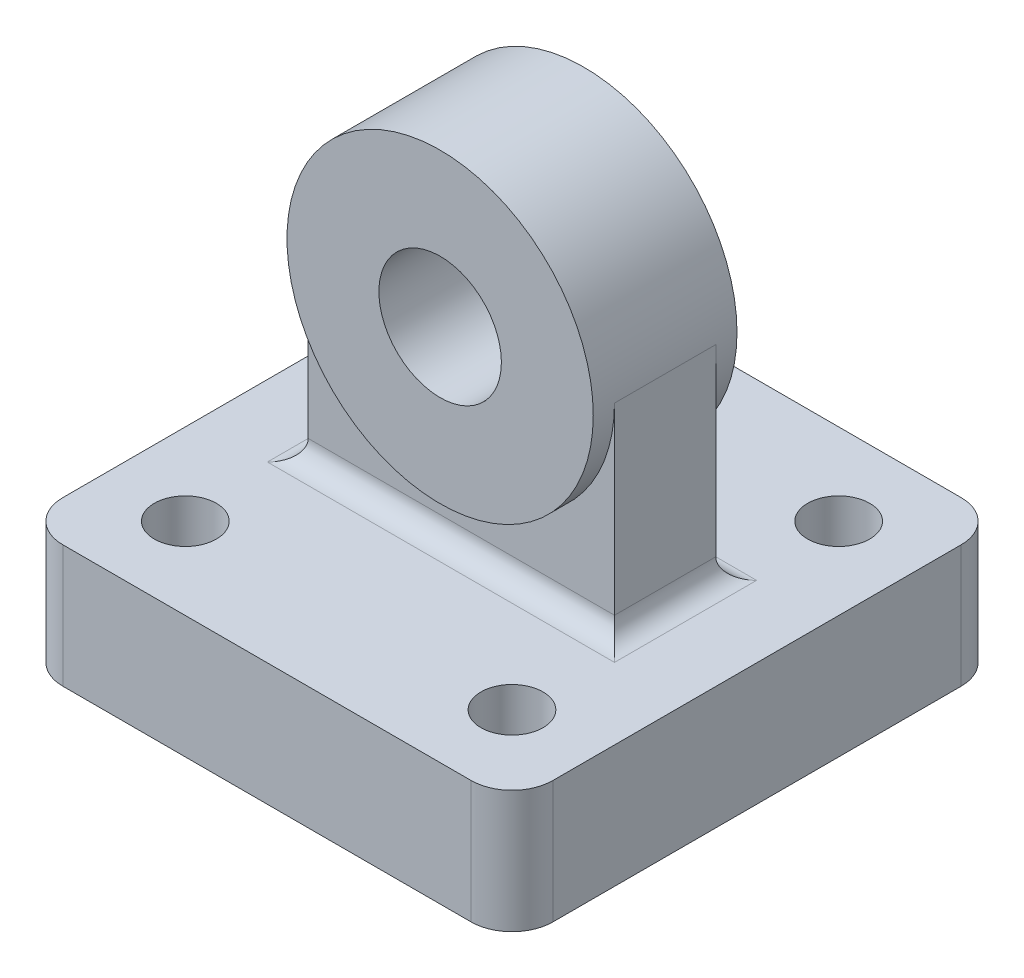
ISO-10303-21;
HEADER;
FILE_DESCRIPTION(('STEP AP214'),'2;1');
FILE_NAME('part.step','',(''),(''),'','','');
FILE_SCHEMA(('AUTOMOTIVE_DESIGN { 1 0 10303 214 1 1 1 1 }'));
ENDSEC;
DATA;
#1=APPLICATION_CONTEXT('core data for automotive mechanical design processes');
#2=APPLICATION_PROTOCOL_DEFINITION('international standard','automotive_design',2000,#1);
#3=PRODUCT_CONTEXT('',#1,'mechanical');
#4=PRODUCT('Part','Part','',(#3));
#5=PRODUCT_RELATED_PRODUCT_CATEGORY('part','',(#4));
#6=PRODUCT_DEFINITION_FORMATION('','',#4);
#7=PRODUCT_DEFINITION_CONTEXT('part definition',#1,'design');
#8=PRODUCT_DEFINITION('design','',#6,#7);
#9=PRODUCT_DEFINITION_SHAPE('','',#8);
#10=(LENGTH_UNIT() NAMED_UNIT(*) SI_UNIT(.MILLI.,.METRE.));
#11=(NAMED_UNIT(*) PLANE_ANGLE_UNIT() SI_UNIT($,.RADIAN.));
#12=(NAMED_UNIT(*) SI_UNIT($,.STERADIAN.) SOLID_ANGLE_UNIT());
#13=UNCERTAINTY_MEASURE_WITH_UNIT(LENGTH_MEASURE(1.E-05),#10,'distance_accuracy_value','');
#14=(GEOMETRIC_REPRESENTATION_CONTEXT(3) GLOBAL_UNCERTAINTY_ASSIGNED_CONTEXT((#13)) GLOBAL_UNIT_ASSIGNED_CONTEXT((#10,
#11,#12)) REPRESENTATION_CONTEXT('',''));
#15=CARTESIAN_POINT('',(0.,0.,0.));
#16=DIRECTION('',(0.,0.,1.));
#17=DIRECTION('',(1.,0.,0.));
#18=AXIS2_PLACEMENT_3D('',#15,#16,#17);
#19=CARTESIAN_POINT('',(0.,19.05,0.));
#20=DIRECTION('',(0.,1.,0.));
#21=DIRECTION('',(0.,0.,1.));
#22=AXIS2_PLACEMENT_3D('',#19,#20,#21);
#23=PLANE('',#22);
#24=DIRECTION('',(0.,0.,-1.));
#25=VECTOR('',#24,1.);
#26=CARTESIAN_POINT('',(11.1125,19.05,0.));
#27=LINE('',#26,#25);
#28=CARTESIAN_POINT('',(11.1125,19.05,49.149));
#29=VERTEX_POINT('',#28);
#30=CARTESIAN_POINT('',(11.1125,19.05,27.051));
#31=VERTEX_POINT('',#30);
#32=EDGE_CURVE('E247',#29,#31,#27,.T.);
#33=ORIENTED_EDGE('',*,*,#32,.T.);
#34=DIRECTION('',(1.,0.,0.));
#35=VECTOR('',#34,1.);
#36=CARTESIAN_POINT('',(0.,19.05,27.051));
#37=LINE('',#36,#35);
#38=CARTESIAN_POINT('',(65.0875,19.05,27.051));
#39=VERTEX_POINT('',#38);
#40=EDGE_CURVE('E250',#31,#39,#37,.T.);
#41=ORIENTED_EDGE('',*,*,#40,.T.);
#42=DIRECTION('',(0.,0.,-1.));
#43=VECTOR('',#42,1.);
#44=CARTESIAN_POINT('',(65.0875,19.05,45.974));
#45=LINE('',#44,#43);
#46=CARTESIAN_POINT('',(65.0875,19.05,49.149));
#47=VERTEX_POINT('',#46);
#48=EDGE_CURVE('E228',#39,#47,#45,.F.);
#49=ORIENTED_EDGE('',*,*,#48,.T.);
#50=DIRECTION('',(1.,0.,0.));
#51=VECTOR('',#50,1.);
#52=CARTESIAN_POINT('',(14.2875,19.05,49.149));
#53=LINE('',#52,#51);
#54=EDGE_CURVE('E244',#47,#29,#53,.F.);
#55=ORIENTED_EDGE('',*,*,#54,.T.);
#56=EDGE_LOOP('',(#33,#41,#49,#55));
#57=FACE_BOUND('',#56,.T.);
#58=CARTESIAN_POINT('',(63.4999999999999,19.05,12.7));
#59=DIRECTION('',(0.,1.,0.));
#60=DIRECTION('',(0.,0.,-1.));
#61=AXIS2_PLACEMENT_3D('',#58,#59,#60);
#62=CIRCLE('',#61,4.826);
#63=CARTESIAN_POINT('',(63.4999999999999,19.05,7.874));
#64=VERTEX_POINT('',#63);
#65=EDGE_CURVE('E189',#64,#64,#62,.T.);
#66=ORIENTED_EDGE('',*,*,#65,.F.);
#67=EDGE_LOOP('',(#66));
#68=FACE_BOUND('',#67,.T.);
#69=CARTESIAN_POINT('',(63.5,19.05,63.5));
#70=DIRECTION('',(0.,1.,0.));
#71=DIRECTION('',(0.,0.,1.));
#72=AXIS2_PLACEMENT_3D('',#69,#70,#71);
#73=CIRCLE('',#72,4.826);
#74=CARTESIAN_POINT('',(63.5,19.05,68.326));
#75=VERTEX_POINT('',#74);
#76=EDGE_CURVE('E205',#75,#75,#73,.T.);
#77=ORIENTED_EDGE('',*,*,#76,.F.);
#78=EDGE_LOOP('',(#77));
#79=FACE_BOUND('',#78,.T.);
#80=DIRECTION('',(1.,0.,0.));
#81=VECTOR('',#80,1.);
#82=CARTESIAN_POINT('',(0.,19.05,76.2));
#83=LINE('',#82,#81);
#84=CARTESIAN_POINT('',(6.35,19.05,76.2));
#85=VERTEX_POINT('',#84);
#86=CARTESIAN_POINT('',(69.85,19.05,76.2));
#87=VERTEX_POINT('',#86);
#88=EDGE_CURVE('E217',#85,#87,#83,.T.);
#89=ORIENTED_EDGE('',*,*,#88,.T.);
#90=CARTESIAN_POINT('',(69.85,19.05,69.85));
#91=DIRECTION('',(0.,1.,0.));
#92=DIRECTION('',(0.,0.,1.));
#93=AXIS2_PLACEMENT_3D('',#90,#91,#92);
#94=CIRCLE('',#93,6.35);
#95=CARTESIAN_POINT('',(76.2,19.05,69.85));
#96=VERTEX_POINT('',#95);
#97=EDGE_CURVE('E314',#87,#96,#94,.T.);
#98=ORIENTED_EDGE('',*,*,#97,.T.);
#99=DIRECTION('',(0.,0.,-1.));
#100=VECTOR('',#99,1.);
#101=CARTESIAN_POINT('',(76.2,19.05,0.));
#102=LINE('',#101,#100);
#103=CARTESIAN_POINT('',(76.2,19.05,6.35));
#104=VERTEX_POINT('',#103);
#105=EDGE_CURVE('E222',#96,#104,#102,.T.);
#106=ORIENTED_EDGE('',*,*,#105,.T.);
#107=CARTESIAN_POINT('',(69.85,19.05,6.35));
#108=DIRECTION('',(0.,1.,0.));
#109=DIRECTION('',(0.,0.,1.));
#110=AXIS2_PLACEMENT_3D('',#107,#108,#109);
#111=CIRCLE('',#110,6.35);
#112=CARTESIAN_POINT('',(69.85,19.05,0.));
#113=VERTEX_POINT('',#112);
#114=EDGE_CURVE('E61',#104,#113,#111,.T.);
#115=ORIENTED_EDGE('',*,*,#114,.T.);
#116=DIRECTION('',(-1.,0.,0.));
#117=VECTOR('',#116,1.);
#118=CARTESIAN_POINT('',(0.,19.05,0.));
#119=LINE('',#118,#117);
#120=CARTESIAN_POINT('',(6.35,19.05,0.));
#121=VERTEX_POINT('',#120);
#122=EDGE_CURVE('E225',#113,#121,#119,.T.);
#123=ORIENTED_EDGE('',*,*,#122,.T.);
#124=CARTESIAN_POINT('',(6.35,19.05,6.35));
#125=DIRECTION('',(0.,1.,0.));
#126=DIRECTION('',(0.,0.,1.));
#127=AXIS2_PLACEMENT_3D('',#124,#125,#126);
#128=CIRCLE('',#127,6.35);
#129=CARTESIAN_POINT('',(0.,19.05,6.35));
#130=VERTEX_POINT('',#129);
#131=EDGE_CURVE('E306',#121,#130,#128,.T.);
#132=ORIENTED_EDGE('',*,*,#131,.T.);
#133=DIRECTION('',(0.,0.,1.));
#134=VECTOR('',#133,1.);
#135=CARTESIAN_POINT('',(0.,19.05,0.));
#136=LINE('',#135,#134);
#137=CARTESIAN_POINT('',(0.,19.05,69.85));
#138=VERTEX_POINT('',#137);
#139=EDGE_CURVE('E213',#130,#138,#136,.T.);
#140=ORIENTED_EDGE('',*,*,#139,.T.);
#141=CARTESIAN_POINT('',(6.35,19.05,69.85));
#142=DIRECTION('',(0.,1.,0.));
#143=DIRECTION('',(0.,0.,1.));
#144=AXIS2_PLACEMENT_3D('',#141,#142,#143);
#145=CIRCLE('',#144,6.35);
#146=EDGE_CURVE('E311',#138,#85,#145,.T.);
#147=ORIENTED_EDGE('',*,*,#146,.T.);
#148=EDGE_LOOP('',(#89,#98,#106,#115,#123,#132,#140,#147));
#149=FACE_BOUND('',#148,.T.);
#150=CARTESIAN_POINT('',(12.7,19.05,63.5));
#151=DIRECTION('',(0.,1.,0.));
#152=DIRECTION('',(0.,0.,-1.));
#153=AXIS2_PLACEMENT_3D('',#150,#151,#152);
#154=CIRCLE('',#153,4.826);
#155=CARTESIAN_POINT('',(12.7,19.05,58.674));
#156=VERTEX_POINT('',#155);
#157=EDGE_CURVE('E197',#156,#156,#154,.T.);
#158=ORIENTED_EDGE('',*,*,#157,.F.);
#159=EDGE_LOOP('',(#158));
#160=FACE_BOUND('',#159,.T.);
#161=CARTESIAN_POINT('',(12.7,19.05,12.7));
#162=DIRECTION('',(0.,1.,0.));
#163=DIRECTION('',(0.,0.,1.));
#164=AXIS2_PLACEMENT_3D('',#161,#162,#163);
#165=CIRCLE('',#164,4.826);
#166=CARTESIAN_POINT('',(12.7,19.05,17.526));
#167=VERTEX_POINT('',#166);
#168=EDGE_CURVE('E181',#167,#167,#165,.T.);
#169=ORIENTED_EDGE('',*,*,#168,.F.);
#170=EDGE_LOOP('',(#169));
#171=FACE_BOUND('',#170,.T.);
#172=ADVANCED_FACE('F39',(#57,#68,#79,#149,#160,#171),#23,.T.);
#173=CARTESIAN_POINT('',(0.,0.,0.));
#174=DIRECTION('',(0.,1.,0.));
#175=DIRECTION('',(0.,0.,1.));
#176=AXIS2_PLACEMENT_3D('',#173,#174,#175);
#177=PLANE('',#176);
#178=DIRECTION('',(0.,0.,-1.));
#179=VECTOR('',#178,1.);
#180=CARTESIAN_POINT('',(76.2,0.,0.));
#181=LINE('',#180,#179);
#182=CARTESIAN_POINT('',(76.2,0.,69.85));
#183=VERTEX_POINT('',#182);
#184=CARTESIAN_POINT('',(76.2,0.,6.35));
#185=VERTEX_POINT('',#184);
#186=EDGE_CURVE('E236',#183,#185,#181,.T.);
#187=ORIENTED_EDGE('',*,*,#186,.F.);
#188=CARTESIAN_POINT('',(69.85,0.,69.85));
#189=DIRECTION('',(0.,1.,0.));
#190=DIRECTION('',(0.,0.,1.));
#191=AXIS2_PLACEMENT_3D('',#188,#189,#190);
#192=CIRCLE('',#191,6.35);
#193=CARTESIAN_POINT('',(69.85,0.,76.2));
#194=VERTEX_POINT('',#193);
#195=EDGE_CURVE('E296',#183,#194,#192,.F.);
#196=ORIENTED_EDGE('',*,*,#195,.T.);
#197=DIRECTION('',(1.,0.,0.));
#198=VECTOR('',#197,1.);
#199=CARTESIAN_POINT('',(0.,0.,76.2));
#200=LINE('',#199,#198);
#201=CARTESIAN_POINT('',(6.35,0.,76.2));
#202=VERTEX_POINT('',#201);
#203=EDGE_CURVE('E232',#202,#194,#200,.T.);
#204=ORIENTED_EDGE('',*,*,#203,.F.);
#205=CARTESIAN_POINT('',(6.35,0.,69.85));
#206=DIRECTION('',(0.,1.,0.));
#207=DIRECTION('',(0.,0.,1.));
#208=AXIS2_PLACEMENT_3D('',#205,#206,#207);
#209=CIRCLE('',#208,6.35);
#210=CARTESIAN_POINT('',(0.,0.,69.85));
#211=VERTEX_POINT('',#210);
#212=EDGE_CURVE('E293',#202,#211,#209,.F.);
#213=ORIENTED_EDGE('',*,*,#212,.T.);
#214=DIRECTION('',(0.,0.,1.));
#215=VECTOR('',#214,1.);
#216=CARTESIAN_POINT('',(0.,0.,0.));
#217=LINE('',#216,#215);
#218=CARTESIAN_POINT('',(0.,0.,6.35));
#219=VERTEX_POINT('',#218);
#220=EDGE_CURVE('E209',#219,#211,#217,.T.);
#221=ORIENTED_EDGE('',*,*,#220,.F.);
#222=CARTESIAN_POINT('',(6.35,0.,6.35));
#223=DIRECTION('',(0.,1.,0.));
#224=DIRECTION('',(0.,0.,1.));
#225=AXIS2_PLACEMENT_3D('',#222,#223,#224);
#226=CIRCLE('',#225,6.35);
#227=CARTESIAN_POINT('',(6.35,0.,0.));
#228=VERTEX_POINT('',#227);
#229=EDGE_CURVE('E287',#219,#228,#226,.F.);
#230=ORIENTED_EDGE('',*,*,#229,.T.);
#231=DIRECTION('',(-1.,0.,0.));
#232=VECTOR('',#231,1.);
#233=CARTESIAN_POINT('',(0.,0.,0.));
#234=LINE('',#233,#232);
#235=CARTESIAN_POINT('',(69.85,0.,0.));
#236=VERTEX_POINT('',#235);
#237=EDGE_CURVE('E218',#236,#228,#234,.T.);
#238=ORIENTED_EDGE('',*,*,#237,.F.);
#239=CARTESIAN_POINT('',(69.85,0.,6.35));
#240=DIRECTION('',(0.,1.,0.));
#241=DIRECTION('',(0.,0.,1.));
#242=AXIS2_PLACEMENT_3D('',#239,#240,#241);
#243=CIRCLE('',#242,6.35);
#244=EDGE_CURVE('E290',#236,#185,#243,.F.);
#245=ORIENTED_EDGE('',*,*,#244,.T.);
#246=EDGE_LOOP('',(#187,#196,#204,#213,#221,#230,#238,#245));
#247=FACE_BOUND('',#246,.T.);
#248=CARTESIAN_POINT('',(63.5,0.,63.5));
#249=DIRECTION('',(0.,1.,0.));
#250=DIRECTION('',(0.,0.,1.));
#251=AXIS2_PLACEMENT_3D('',#248,#249,#250);
#252=CIRCLE('',#251,4.826);
#253=CARTESIAN_POINT('',(63.5,0.,68.326));
#254=VERTEX_POINT('',#253);
#255=EDGE_CURVE('E201',#254,#254,#252,.T.);
#256=ORIENTED_EDGE('',*,*,#255,.T.);
#257=EDGE_LOOP('',(#256));
#258=FACE_BOUND('',#257,.T.);
#259=CARTESIAN_POINT('',(12.7,0.,63.5));
#260=DIRECTION('',(0.,1.,0.));
#261=DIRECTION('',(0.,0.,-1.));
#262=AXIS2_PLACEMENT_3D('',#259,#260,#261);
#263=CIRCLE('',#262,4.826);
#264=CARTESIAN_POINT('',(12.7,0.,58.674));
#265=VERTEX_POINT('',#264);
#266=EDGE_CURVE('E193',#265,#265,#263,.T.);
#267=ORIENTED_EDGE('',*,*,#266,.T.);
#268=EDGE_LOOP('',(#267));
#269=FACE_BOUND('',#268,.T.);
#270=CARTESIAN_POINT('',(63.4999999999999,0.,12.7));
#271=DIRECTION('',(0.,1.,0.));
#272=DIRECTION('',(0.,0.,-1.));
#273=AXIS2_PLACEMENT_3D('',#270,#271,#272);
#274=CIRCLE('',#273,4.826);
#275=CARTESIAN_POINT('',(63.4999999999999,0.,7.874));
#276=VERTEX_POINT('',#275);
#277=EDGE_CURVE('E185',#276,#276,#274,.T.);
#278=ORIENTED_EDGE('',*,*,#277,.T.);
#279=EDGE_LOOP('',(#278));
#280=FACE_BOUND('',#279,.T.);
#281=CARTESIAN_POINT('',(12.7,0.,12.7));
#282=DIRECTION('',(0.,1.,0.));
#283=DIRECTION('',(0.,0.,1.));
#284=AXIS2_PLACEMENT_3D('',#281,#282,#283);
#285=CIRCLE('',#284,4.826);
#286=CARTESIAN_POINT('',(12.7,0.,17.526));
#287=VERTEX_POINT('',#286);
#288=EDGE_CURVE('E164',#287,#287,#285,.T.);
#289=ORIENTED_EDGE('',*,*,#288,.T.);
#290=EDGE_LOOP('',(#289));
#291=FACE_BOUND('',#290,.T.);
#292=ADVANCED_FACE('F371',(#247,#258,#269,#280,#291),#177,.F.);
#293=CARTESIAN_POINT('',(0.,19.05,0.));
#294=DIRECTION('',(1.,0.,0.));
#295=DIRECTION('',(0.,0.,-1.));
#296=AXIS2_PLACEMENT_3D('',#293,#294,#295);
#297=PLANE('',#296);
#298=ORIENTED_EDGE('',*,*,#220,.T.);
#299=DIRECTION('',(0.,-1.,0.));
#300=VECTOR('',#299,1.);
#301=CARTESIAN_POINT('',(0.,19.05,69.85));
#302=LINE('',#301,#300);
#303=EDGE_CURVE('E321',#211,#138,#302,.F.);
#304=ORIENTED_EDGE('',*,*,#303,.T.);
#305=ORIENTED_EDGE('',*,*,#139,.F.);
#306=DIRECTION('',(0.,-1.,0.));
#307=VECTOR('',#306,1.);
#308=CARTESIAN_POINT('',(0.,19.05,6.35));
#309=LINE('',#308,#307);
#310=EDGE_CURVE('E317',#130,#219,#309,.T.);
#311=ORIENTED_EDGE('',*,*,#310,.T.);
#312=EDGE_LOOP('',(#298,#304,#305,#311));
#313=FACE_BOUND('',#312,.T.);
#314=ADVANCED_FACE('F377',(#313),#297,.F.);
#315=CARTESIAN_POINT('',(0.,19.05,76.2));
#316=DIRECTION('',(0.,0.,-1.));
#317=DIRECTION('',(-1.,0.,0.));
#318=AXIS2_PLACEMENT_3D('',#315,#316,#317);
#319=PLANE('',#318);
#320=ORIENTED_EDGE('',*,*,#203,.T.);
#321=DIRECTION('',(0.,-1.,0.));
#322=VECTOR('',#321,1.);
#323=CARTESIAN_POINT('',(69.85,19.05,76.2));
#324=LINE('',#323,#322);
#325=EDGE_CURVE('E303',#194,#87,#324,.F.);
#326=ORIENTED_EDGE('',*,*,#325,.T.);
#327=ORIENTED_EDGE('',*,*,#88,.F.);
#328=DIRECTION('',(0.,-1.,0.));
#329=VECTOR('',#328,1.);
#330=CARTESIAN_POINT('',(6.35,19.05,76.2));
#331=LINE('',#330,#329);
#332=EDGE_CURVE('E299',#85,#202,#331,.T.);
#333=ORIENTED_EDGE('',*,*,#332,.T.);
#334=EDGE_LOOP('',(#320,#326,#327,#333));
#335=FACE_BOUND('',#334,.T.);
#336=ADVANCED_FACE('F391',(#335),#319,.F.);
#337=CARTESIAN_POINT('',(76.2,19.05,0.));
#338=DIRECTION('',(-1.,0.,0.));
#339=DIRECTION('',(0.,0.,1.));
#340=AXIS2_PLACEMENT_3D('',#337,#338,#339);
#341=PLANE('',#340);
#342=ORIENTED_EDGE('',*,*,#105,.F.);
#343=DIRECTION('',(0.,-1.,0.));
#344=VECTOR('',#343,1.);
#345=CARTESIAN_POINT('',(76.2,19.05,69.85));
#346=LINE('',#345,#344);
#347=EDGE_CURVE('E283',#96,#183,#346,.T.);
#348=ORIENTED_EDGE('',*,*,#347,.T.);
#349=ORIENTED_EDGE('',*,*,#186,.T.);
#350=DIRECTION('',(0.,-1.,0.));
#351=VECTOR('',#350,1.);
#352=CARTESIAN_POINT('',(76.2,19.05,6.35));
#353=LINE('',#352,#351);
#354=EDGE_CURVE('E265',#185,#104,#353,.F.);
#355=ORIENTED_EDGE('',*,*,#354,.T.);
#356=EDGE_LOOP('',(#342,#348,#349,#355));
#357=FACE_BOUND('',#356,.T.);
#358=ADVANCED_FACE('F388',(#357),#341,.F.);
#359=CARTESIAN_POINT('',(0.,19.05,0.));
#360=DIRECTION('',(0.,0.,1.));
#361=DIRECTION('',(1.,0.,0.));
#362=AXIS2_PLACEMENT_3D('',#359,#360,#361);
#363=PLANE('',#362);
#364=ORIENTED_EDGE('',*,*,#122,.F.);
#365=DIRECTION('',(0.,-1.,0.));
#366=VECTOR('',#365,1.);
#367=CARTESIAN_POINT('',(69.85,19.05,0.));
#368=LINE('',#367,#366);
#369=EDGE_CURVE('E11',#113,#236,#368,.T.);
#370=ORIENTED_EDGE('',*,*,#369,.T.);
#371=ORIENTED_EDGE('',*,*,#237,.T.);
#372=DIRECTION('',(0.,-1.,0.));
#373=VECTOR('',#372,1.);
#374=CARTESIAN_POINT('',(6.35,19.05,0.));
#375=LINE('',#374,#373);
#376=EDGE_CURVE('E48',#228,#121,#375,.F.);
#377=ORIENTED_EDGE('',*,*,#376,.T.);
#378=EDGE_LOOP('',(#364,#370,#371,#377));
#379=FACE_BOUND('',#378,.T.);
#380=ADVANCED_FACE('F385',(#379),#363,.F.);
#381=CARTESIAN_POINT('',(63.5,19.05,63.5));
#382=DIRECTION('',(0.,-1.,0.));
#383=DIRECTION('',(0.,0.,-1.));
#384=AXIS2_PLACEMENT_3D('',#381,#382,#383);
#385=CYLINDRICAL_SURFACE('',#384,4.826);
#386=ORIENTED_EDGE('',*,*,#76,.T.);
#387=EDGE_LOOP('',(#386));
#388=FACE_BOUND('',#387,.T.);
#389=ORIENTED_EDGE('',*,*,#255,.F.);
#390=EDGE_LOOP('',(#389));
#391=FACE_BOUND('',#390,.T.);
#392=ADVANCED_FACE('F382',(#388,#391),#385,.F.);
#393=CARTESIAN_POINT('',(12.7,19.05,63.5));
#394=DIRECTION('',(0.,-1.,0.));
#395=DIRECTION('',(0.,0.,-1.));
#396=AXIS2_PLACEMENT_3D('',#393,#394,#395);
#397=CYLINDRICAL_SURFACE('',#396,4.826);
#398=ORIENTED_EDGE('',*,*,#157,.T.);
#399=EDGE_LOOP('',(#398));
#400=FACE_BOUND('',#399,.T.);
#401=ORIENTED_EDGE('',*,*,#266,.F.);
#402=EDGE_LOOP('',(#401));
#403=FACE_BOUND('',#402,.T.);
#404=ADVANCED_FACE('F460',(#400,#403),#397,.F.);
#405=CARTESIAN_POINT('',(63.4999999999999,19.05,12.7));
#406=DIRECTION('',(0.,-1.,0.));
#407=DIRECTION('',(0.,0.,-1.));
#408=AXIS2_PLACEMENT_3D('',#405,#406,#407);
#409=CYLINDRICAL_SURFACE('',#408,4.826);
#410=ORIENTED_EDGE('',*,*,#65,.T.);
#411=EDGE_LOOP('',(#410));
#412=FACE_BOUND('',#411,.T.);
#413=ORIENTED_EDGE('',*,*,#277,.F.);
#414=EDGE_LOOP('',(#413));
#415=FACE_BOUND('',#414,.T.);
#416=ADVANCED_FACE('F450',(#412,#415),#409,.F.);
#417=CARTESIAN_POINT('',(12.7,19.05,12.7));
#418=DIRECTION('',(0.,-1.,0.));
#419=DIRECTION('',(0.,0.,-1.));
#420=AXIS2_PLACEMENT_3D('',#417,#418,#419);
#421=CYLINDRICAL_SURFACE('',#420,4.826);
#422=ORIENTED_EDGE('',*,*,#168,.T.);
#423=EDGE_LOOP('',(#422));
#424=FACE_BOUND('',#423,.T.);
#425=ORIENTED_EDGE('',*,*,#288,.F.);
#426=EDGE_LOOP('',(#425));
#427=FACE_BOUND('',#426,.T.);
#428=ADVANCED_FACE('F447',(#424,#427),#421,.F.);
#429=CARTESIAN_POINT('',(14.2875,0.,45.974));
#430=DIRECTION('',(1.,0.,0.));
#431=DIRECTION('',(0.,1.,0.));
#432=AXIS2_PLACEMENT_3D('',#429,#430,#431);
#433=PLANE('',#432);
#434=DIRECTION('',(0.,-1.,0.));
#435=VECTOR('',#434,1.);
#436=CARTESIAN_POINT('',(14.2875,0.,30.226));
#437=LINE('',#436,#435);
#438=CARTESIAN_POINT('',(14.2875,50.8,30.226));
#439=VERTEX_POINT('',#438);
#440=CARTESIAN_POINT('',(14.2875,22.225,30.226));
#441=VERTEX_POINT('',#440);
#442=EDGE_CURVE('E154',#439,#441,#437,.T.);
#443=ORIENTED_EDGE('',*,*,#442,.T.);
#444=DIRECTION('',(0.,0.,-1.));
#445=VECTOR('',#444,1.);
#446=CARTESIAN_POINT('',(14.2875,22.225,45.974));
#447=LINE('',#446,#445);
#448=CARTESIAN_POINT('',(14.2875,22.225,45.974));
#449=VERTEX_POINT('',#448);
#450=EDGE_CURVE('E256',#441,#449,#447,.F.);
#451=ORIENTED_EDGE('',*,*,#450,.T.);
#452=DIRECTION('',(0.,-1.,0.));
#453=VECTOR('',#452,1.);
#454=CARTESIAN_POINT('',(14.2875,0.,45.974));
#455=LINE('',#454,#453);
#456=CARTESIAN_POINT('',(14.2875,50.8,45.974));
#457=VERTEX_POINT('',#456);
#458=EDGE_CURVE('E161',#457,#449,#455,.T.);
#459=ORIENTED_EDGE('',*,*,#458,.F.);
#460=DIRECTION('',(0.,0.,-1.));
#461=VECTOR('',#460,1.);
#462=CARTESIAN_POINT('',(14.2875,50.8,45.974));
#463=LINE('',#462,#461);
#464=EDGE_CURVE('E145',#457,#439,#463,.T.);
#465=ORIENTED_EDGE('',*,*,#464,.T.);
#466=EDGE_LOOP('',(#443,#451,#459,#465));
#467=FACE_BOUND('',#466,.T.);
#468=ADVANCED_FACE('F159',(#467),#433,.F.);
#469=CARTESIAN_POINT('',(61.9125,0.,45.974));
#470=DIRECTION('',(1.,0.,0.));
#471=DIRECTION('',(0.,1.,0.));
#472=AXIS2_PLACEMENT_3D('',#469,#470,#471);
#473=PLANE('',#472);
#474=DIRECTION('',(0.,-1.,0.));
#475=VECTOR('',#474,1.);
#476=CARTESIAN_POINT('',(61.9125,0.,45.974));
#477=LINE('',#476,#475);
#478=CARTESIAN_POINT('',(61.9125,50.8,45.974));
#479=VERTEX_POINT('',#478);
#480=CARTESIAN_POINT('',(61.9125,22.225,45.974));
#481=VERTEX_POINT('',#480);
#482=EDGE_CURVE('E179',#479,#481,#477,.T.);
#483=ORIENTED_EDGE('',*,*,#482,.T.);
#484=DIRECTION('',(0.,0.,-1.));
#485=VECTOR('',#484,1.);
#486=CARTESIAN_POINT('',(61.9125,22.225,30.226));
#487=LINE('',#486,#485);
#488=CARTESIAN_POINT('',(61.9125,22.225,30.226));
#489=VERTEX_POINT('',#488);
#490=EDGE_CURVE('E262',#481,#489,#487,.T.);
#491=ORIENTED_EDGE('',*,*,#490,.T.);
#492=DIRECTION('',(0.,-1.,0.));
#493=VECTOR('',#492,1.);
#494=CARTESIAN_POINT('',(61.9125,0.,30.226));
#495=LINE('',#494,#493);
#496=CARTESIAN_POINT('',(61.9125,50.8,30.226));
#497=VERTEX_POINT('',#496);
#498=EDGE_CURVE('E171',#497,#489,#495,.T.);
#499=ORIENTED_EDGE('',*,*,#498,.F.);
#500=DIRECTION('',(0.,0.,-1.));
#501=VECTOR('',#500,1.);
#502=CARTESIAN_POINT('',(61.9125,50.8,45.974));
#503=LINE('',#502,#501);
#504=EDGE_CURVE('E148',#479,#497,#503,.T.);
#505=ORIENTED_EDGE('',*,*,#504,.F.);
#506=EDGE_LOOP('',(#483,#491,#499,#505));
#507=FACE_BOUND('',#506,.T.);
#508=ADVANCED_FACE('F458',(#507),#473,.T.);
#509=CARTESIAN_POINT('',(0.,0.,45.974));
#510=DIRECTION('',(0.,0.,1.));
#511=DIRECTION('',(1.,0.,0.));
#512=AXIS2_PLACEMENT_3D('',#509,#510,#511);
#513=PLANE('',#512);
#514=ORIENTED_EDGE('',*,*,#458,.T.);
#515=DIRECTION('',(1.,0.,0.));
#516=VECTOR('',#515,1.);
#517=CARTESIAN_POINT('',(61.9125,22.225,45.974));
#518=LINE('',#517,#516);
#519=EDGE_CURVE('E259',#449,#481,#518,.T.);
#520=ORIENTED_EDGE('',*,*,#519,.T.);
#521=ORIENTED_EDGE('',*,*,#482,.F.);
#522=CARTESIAN_POINT('',(38.1,50.8,45.974));
#523=DIRECTION('',(0.,0.,1.));
#524=DIRECTION('',(1.,0.,0.));
#525=AXIS2_PLACEMENT_3D('',#522,#523,#524);
#526=CIRCLE('',#525,23.8125);
#527=EDGE_CURVE('E174',#457,#479,#526,.T.);
#528=ORIENTED_EDGE('',*,*,#527,.F.);
#529=EDGE_LOOP('',(#514,#520,#521,#528));
#530=FACE_BOUND('',#529,.T.);
#531=ADVANCED_FACE('F542',(#530),#513,.T.);
#532=CARTESIAN_POINT('',(0.,0.,30.226));
#533=DIRECTION('',(0.,0.,1.));
#534=DIRECTION('',(1.,0.,0.));
#535=AXIS2_PLACEMENT_3D('',#532,#533,#534);
#536=PLANE('',#535);
#537=ORIENTED_EDGE('',*,*,#498,.T.);
#538=DIRECTION('',(1.,0.,0.));
#539=VECTOR('',#538,1.);
#540=CARTESIAN_POINT('',(0.,22.225,30.226));
#541=LINE('',#540,#539);
#542=EDGE_CURVE('E169',#489,#441,#541,.F.);
#543=ORIENTED_EDGE('',*,*,#542,.T.);
#544=ORIENTED_EDGE('',*,*,#442,.F.);
#545=CARTESIAN_POINT('',(38.1,50.8,30.226));
#546=DIRECTION('',(0.,0.,1.));
#547=DIRECTION('',(1.,0.,0.));
#548=AXIS2_PLACEMENT_3D('',#545,#546,#547);
#549=CIRCLE('',#548,23.8125);
#550=EDGE_CURVE('E141',#439,#497,#549,.T.);
#551=ORIENTED_EDGE('',*,*,#550,.T.);
#552=EDGE_LOOP('',(#537,#543,#544,#551));
#553=FACE_BOUND('',#552,.T.);
#554=ADVANCED_FACE('F167',(#553),#536,.F.);
#555=CARTESIAN_POINT('',(38.1,50.8,49.276));
#556=DIRECTION('',(0.,0.,-1.));
#557=DIRECTION('',(-1.,0.,0.));
#558=AXIS2_PLACEMENT_3D('',#555,#556,#557);
#559=CYLINDRICAL_SURFACE('',#558,9.525);
#560=CARTESIAN_POINT('',(38.1,50.8,49.276));
#561=DIRECTION('',(0.,0.,1.));
#562=DIRECTION('',(1.,0.,0.));
#563=AXIS2_PLACEMENT_3D('',#560,#561,#562);
#564=CIRCLE('',#563,9.525);
#565=CARTESIAN_POINT('',(47.625,50.8,49.276));
#566=VERTEX_POINT('',#565);
#567=EDGE_CURVE('E335',#566,#566,#564,.T.);
#568=ORIENTED_EDGE('',*,*,#567,.T.);
#569=EDGE_LOOP('',(#568));
#570=FACE_BOUND('',#569,.T.);
#571=CARTESIAN_POINT('',(38.1,50.8,26.924));
#572=DIRECTION('',(0.,0.,1.));
#573=DIRECTION('',(1.,0.,0.));
#574=AXIS2_PLACEMENT_3D('',#571,#572,#573);
#575=CIRCLE('',#574,9.525);
#576=CARTESIAN_POINT('',(47.625,50.8,26.924));
#577=VERTEX_POINT('',#576);
#578=EDGE_CURVE('E280',#577,#577,#575,.T.);
#579=ORIENTED_EDGE('',*,*,#578,.F.);
#580=EDGE_LOOP('',(#579));
#581=FACE_BOUND('',#580,.T.);
#582=ADVANCED_FACE('F346',(#570,#581),#559,.F.);
#583=CARTESIAN_POINT('',(38.1,50.8,49.276));
#584=DIRECTION('',(0.,0.,-1.));
#585=DIRECTION('',(-1.,0.,0.));
#586=AXIS2_PLACEMENT_3D('',#583,#584,#585);
#587=CYLINDRICAL_SURFACE('',#586,23.8125);
#588=ORIENTED_EDGE('',*,*,#527,.T.);
#589=ORIENTED_EDGE('',*,*,#504,.T.);
#590=ORIENTED_EDGE('',*,*,#550,.F.);
#591=ORIENTED_EDGE('',*,*,#464,.F.);
#592=EDGE_LOOP('',(#588,#589,#590,#591));
#593=FACE_BOUND('',#592,.T.);
#594=CARTESIAN_POINT('',(38.1,50.8,49.276));
#595=DIRECTION('',(0.,0.,1.));
#596=DIRECTION('',(1.,0.,0.));
#597=AXIS2_PLACEMENT_3D('',#594,#595,#596);
#598=CIRCLE('',#597,23.8125);
#599=CARTESIAN_POINT('',(61.9125,50.8,49.276));
#600=VERTEX_POINT('',#599);
#601=EDGE_CURVE('E155',#600,#600,#598,.T.);
#602=ORIENTED_EDGE('',*,*,#601,.F.);
#603=EDGE_LOOP('',(#602));
#604=FACE_BOUND('',#603,.T.);
#605=CARTESIAN_POINT('',(38.1,50.8,26.924));
#606=DIRECTION('',(0.,0.,1.));
#607=DIRECTION('',(1.,0.,0.));
#608=AXIS2_PLACEMENT_3D('',#605,#606,#607);
#609=CIRCLE('',#608,23.8125);
#610=CARTESIAN_POINT('',(61.9125,50.8,26.924));
#611=VERTEX_POINT('',#610);
#612=EDGE_CURVE('E331',#611,#611,#609,.T.);
#613=ORIENTED_EDGE('',*,*,#612,.T.);
#614=EDGE_LOOP('',(#613));
#615=FACE_BOUND('',#614,.T.);
#616=ADVANCED_FACE('F143',(#593,#604,#615),#587,.T.);
#617=CARTESIAN_POINT('',(0.,0.,49.276));
#618=DIRECTION('',(0.,0.,1.));
#619=DIRECTION('',(1.,0.,0.));
#620=AXIS2_PLACEMENT_3D('',#617,#618,#619);
#621=PLANE('',#620);
#622=ORIENTED_EDGE('',*,*,#567,.F.);
#623=EDGE_LOOP('',(#622));
#624=FACE_BOUND('',#623,.T.);
#625=ORIENTED_EDGE('',*,*,#601,.T.);
#626=EDGE_LOOP('',(#625));
#627=FACE_BOUND('',#626,.T.);
#628=ADVANCED_FACE('F349',(#624,#627),#621,.T.);
#629=CARTESIAN_POINT('',(0.,0.,26.924));
#630=DIRECTION('',(0.,0.,1.));
#631=DIRECTION('',(1.,0.,0.));
#632=AXIS2_PLACEMENT_3D('',#629,#630,#631);
#633=PLANE('',#632);
#634=ORIENTED_EDGE('',*,*,#578,.T.);
#635=EDGE_LOOP('',(#634));
#636=FACE_BOUND('',#635,.T.);
#637=ORIENTED_EDGE('',*,*,#612,.F.);
#638=EDGE_LOOP('',(#637));
#639=FACE_BOUND('',#638,.T.);
#640=ADVANCED_FACE('F352',(#636,#639),#633,.F.);
#641=CARTESIAN_POINT('',(0.,22.225,49.149));
#642=DIRECTION('',(-1.,0.,0.));
#643=DIRECTION('',(0.,0.,1.));
#644=AXIS2_PLACEMENT_3D('',#641,#642,#643);
#645=CYLINDRICAL_SURFACE('',#644,3.175);
#646=CARTESIAN_POINT('',(65.0875,22.225,49.149));
#647=DIRECTION('',(-0.707106781186547,0.,0.707106781186547));
#648=DIRECTION('',(0.707106781186547,0.,0.707106781186547));
#649=AXIS2_PLACEMENT_3D('',#646,#647,#648);
#650=ELLIPSE('',#649,4.49012806053458,3.175);
#651=EDGE_CURVE('E272',#481,#47,#650,.T.);
#652=ORIENTED_EDGE('',*,*,#651,.F.);
#653=ORIENTED_EDGE('',*,*,#519,.F.);
#654=CARTESIAN_POINT('',(11.1125,22.225,49.149));
#655=DIRECTION('',(-0.707106781186547,0.,-0.707106781186547));
#656=DIRECTION('',(-0.707106781186547,0.,0.707106781186547));
#657=AXIS2_PLACEMENT_3D('',#654,#655,#656);
#658=ELLIPSE('',#657,4.49012806053458,3.175);
#659=EDGE_CURVE('E276',#29,#449,#658,.F.);
#660=ORIENTED_EDGE('',*,*,#659,.F.);
#661=ORIENTED_EDGE('',*,*,#54,.F.);
#662=EDGE_LOOP('',(#652,#653,#660,#661));
#663=FACE_BOUND('',#662,.T.);
#664=ADVANCED_FACE('F361',(#663),#645,.F.);
#665=CARTESIAN_POINT('',(11.1125,22.225,0.));
#666=DIRECTION('',(0.,0.,-1.));
#667=DIRECTION('',(-1.,0.,0.));
#668=AXIS2_PLACEMENT_3D('',#665,#666,#667);
#669=CYLINDRICAL_SURFACE('',#668,3.175);
#670=ORIENTED_EDGE('',*,*,#659,.T.);
#671=ORIENTED_EDGE('',*,*,#450,.F.);
#672=CARTESIAN_POINT('',(11.1125,22.225,27.051));
#673=DIRECTION('',(0.707106781186547,0.,-0.707106781186547));
#674=DIRECTION('',(-0.707106781186547,0.,-0.707106781186547));
#675=AXIS2_PLACEMENT_3D('',#672,#673,#674);
#676=ELLIPSE('',#675,4.49012806053458,3.175);
#677=EDGE_CURVE('E269',#31,#441,#676,.F.);
#678=ORIENTED_EDGE('',*,*,#677,.F.);
#679=ORIENTED_EDGE('',*,*,#32,.F.);
#680=EDGE_LOOP('',(#670,#671,#678,#679));
#681=FACE_BOUND('',#680,.T.);
#682=ADVANCED_FACE('F367',(#681),#669,.F.);
#683=CARTESIAN_POINT('',(65.0875,22.225,45.974));
#684=DIRECTION('',(0.,0.,1.));
#685=DIRECTION('',(1.,0.,0.));
#686=AXIS2_PLACEMENT_3D('',#683,#684,#685);
#687=CYLINDRICAL_SURFACE('',#686,3.175);
#688=ORIENTED_EDGE('',*,*,#651,.T.);
#689=ORIENTED_EDGE('',*,*,#48,.F.);
#690=CARTESIAN_POINT('',(65.0875,22.225,27.051));
#691=DIRECTION('',(0.707106781186547,0.,0.707106781186547));
#692=DIRECTION('',(-0.707106781186547,0.,0.707106781186547));
#693=AXIS2_PLACEMENT_3D('',#690,#691,#692);
#694=ELLIPSE('',#693,4.49012806053458,3.175);
#695=EDGE_CURVE('E266',#489,#39,#694,.T.);
#696=ORIENTED_EDGE('',*,*,#695,.F.);
#697=ORIENTED_EDGE('',*,*,#490,.F.);
#698=EDGE_LOOP('',(#688,#689,#696,#697));
#699=FACE_BOUND('',#698,.T.);
#700=ADVANCED_FACE('F403',(#699),#687,.F.);
#701=CARTESIAN_POINT('',(0.,22.225,27.051));
#702=DIRECTION('',(1.,0.,0.));
#703=DIRECTION('',(0.,0.,-1.));
#704=AXIS2_PLACEMENT_3D('',#701,#702,#703);
#705=CYLINDRICAL_SURFACE('',#704,3.175);
#706=ORIENTED_EDGE('',*,*,#677,.T.);
#707=ORIENTED_EDGE('',*,*,#542,.F.);
#708=ORIENTED_EDGE('',*,*,#695,.T.);
#709=ORIENTED_EDGE('',*,*,#40,.F.);
#710=EDGE_LOOP('',(#706,#707,#708,#709));
#711=FACE_BOUND('',#710,.T.);
#712=ADVANCED_FACE('F399',(#711),#705,.F.);
#713=CARTESIAN_POINT('',(69.85,19.05,69.85));
#714=DIRECTION('',(0.,-1.,0.));
#715=DIRECTION('',(0.,0.,-1.));
#716=AXIS2_PLACEMENT_3D('',#713,#714,#715);
#717=CYLINDRICAL_SURFACE('',#716,6.35);
#718=ORIENTED_EDGE('',*,*,#97,.F.);
#719=ORIENTED_EDGE('',*,*,#325,.F.);
#720=ORIENTED_EDGE('',*,*,#195,.F.);
#721=ORIENTED_EDGE('',*,*,#347,.F.);
#722=EDGE_LOOP('',(#718,#719,#720,#721));
#723=FACE_BOUND('',#722,.T.);
#724=ADVANCED_FACE('F402',(#723),#717,.T.);
#725=CARTESIAN_POINT('',(6.35,19.05,69.85));
#726=DIRECTION('',(0.,-1.,0.));
#727=DIRECTION('',(0.,0.,-1.));
#728=AXIS2_PLACEMENT_3D('',#725,#726,#727);
#729=CYLINDRICAL_SURFACE('',#728,6.35);
#730=ORIENTED_EDGE('',*,*,#146,.F.);
#731=ORIENTED_EDGE('',*,*,#303,.F.);
#732=ORIENTED_EDGE('',*,*,#212,.F.);
#733=ORIENTED_EDGE('',*,*,#332,.F.);
#734=EDGE_LOOP('',(#730,#731,#732,#733));
#735=FACE_BOUND('',#734,.T.);
#736=ADVANCED_FACE('F413',(#735),#729,.T.);
#737=CARTESIAN_POINT('',(69.85,19.05,6.35));
#738=DIRECTION('',(0.,-1.,0.));
#739=DIRECTION('',(0.,0.,-1.));
#740=AXIS2_PLACEMENT_3D('',#737,#738,#739);
#741=CYLINDRICAL_SURFACE('',#740,6.35);
#742=ORIENTED_EDGE('',*,*,#114,.F.);
#743=ORIENTED_EDGE('',*,*,#354,.F.);
#744=ORIENTED_EDGE('',*,*,#244,.F.);
#745=ORIENTED_EDGE('',*,*,#369,.F.);
#746=EDGE_LOOP('',(#742,#743,#744,#745));
#747=FACE_BOUND('',#746,.T.);
#748=ADVANCED_FACE('F416',(#747),#741,.T.);
#749=CARTESIAN_POINT('',(6.35,19.05,6.35));
#750=DIRECTION('',(0.,-1.,0.));
#751=DIRECTION('',(0.,0.,-1.));
#752=AXIS2_PLACEMENT_3D('',#749,#750,#751);
#753=CYLINDRICAL_SURFACE('',#752,6.35);
#754=ORIENTED_EDGE('',*,*,#131,.F.);
#755=ORIENTED_EDGE('',*,*,#376,.F.);
#756=ORIENTED_EDGE('',*,*,#229,.F.);
#757=ORIENTED_EDGE('',*,*,#310,.F.);
#758=EDGE_LOOP('',(#754,#755,#756,#757));
#759=FACE_BOUND('',#758,.T.);
#760=ADVANCED_FACE('F41',(#759),#753,.T.);
#761=CLOSED_SHELL('',(#172,#292,#314,#336,#358,#380,#392,#404,#416,#428,#468,#508,#531,#554,
#582,#616,#628,#640,#664,#682,#700,#712,#724,#736,#748,#760));
#762=MANIFOLD_SOLID_BREP('B2',#761);
#763=ADVANCED_BREP_SHAPE_REPRESENTATION('',(#18,#762),#14);
#764=SHAPE_DEFINITION_REPRESENTATION(#9,#763);
ENDSEC;
END-ISO-10303-21;
